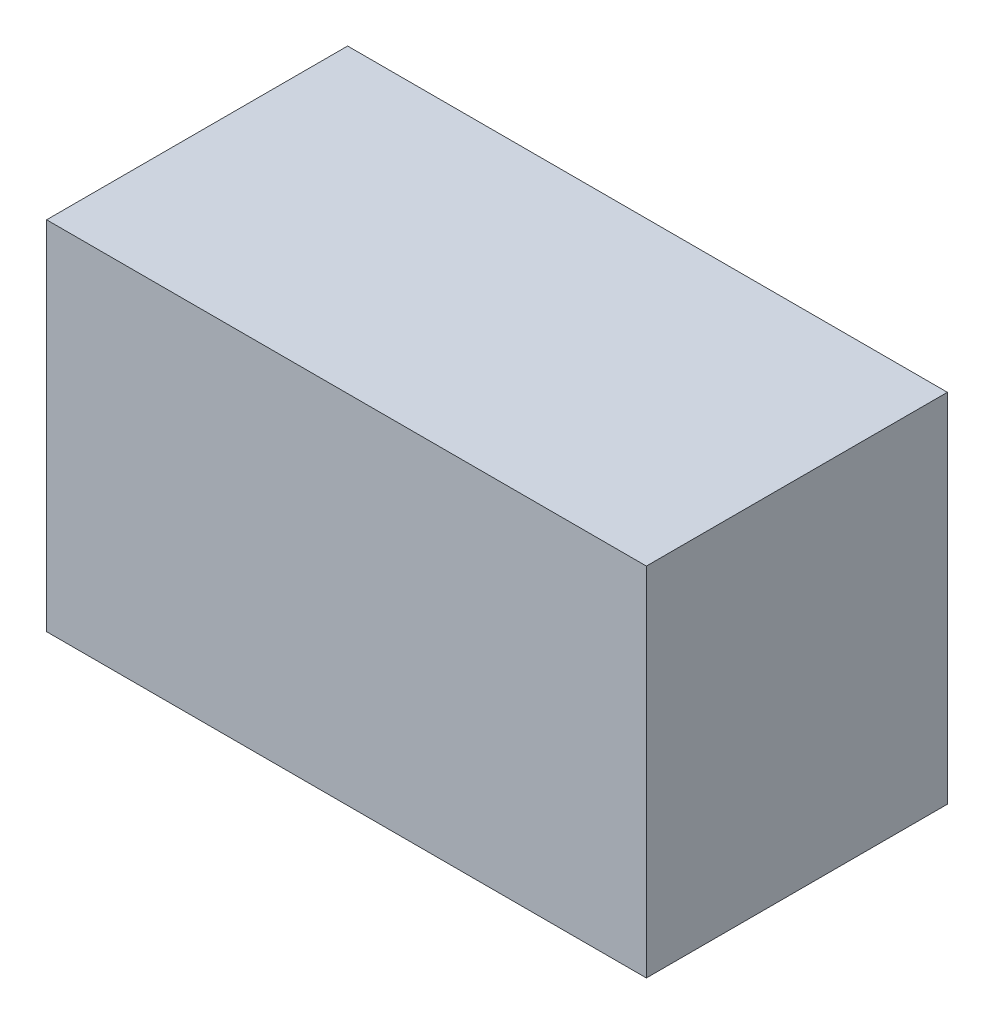
ISO-10303-21;
HEADER;
FILE_DESCRIPTION(('STEP AP214'),'2;1');
FILE_NAME('part.step','',(''),(''),'','','');
FILE_SCHEMA(('AUTOMOTIVE_DESIGN { 1 0 10303 214 1 1 1 1 }'));
ENDSEC;
DATA;
#1=APPLICATION_CONTEXT('core data for automotive mechanical design processes');
#2=APPLICATION_PROTOCOL_DEFINITION('international standard','automotive_design',2000,#1);
#3=PRODUCT_CONTEXT('',#1,'mechanical');
#4=PRODUCT('Part','Part','',(#3));
#5=PRODUCT_RELATED_PRODUCT_CATEGORY('part','',(#4));
#6=PRODUCT_DEFINITION_FORMATION('','',#4);
#7=PRODUCT_DEFINITION_CONTEXT('part definition',#1,'design');
#8=PRODUCT_DEFINITION('design','',#6,#7);
#9=PRODUCT_DEFINITION_SHAPE('','',#8);
#10=(LENGTH_UNIT() NAMED_UNIT(*) SI_UNIT(.MILLI.,.METRE.));
#11=(NAMED_UNIT(*) PLANE_ANGLE_UNIT() SI_UNIT($,.RADIAN.));
#12=(NAMED_UNIT(*) SI_UNIT($,.STERADIAN.) SOLID_ANGLE_UNIT());
#13=UNCERTAINTY_MEASURE_WITH_UNIT(LENGTH_MEASURE(1.E-05),#10,'distance_accuracy_value','');
#14=(GEOMETRIC_REPRESENTATION_CONTEXT(3) GLOBAL_UNCERTAINTY_ASSIGNED_CONTEXT((#13)) GLOBAL_UNIT_ASSIGNED_CONTEXT((#10,
#11,#12)) REPRESENTATION_CONTEXT('',''));
#15=CARTESIAN_POINT('',(0.,0.,0.));
#16=DIRECTION('',(0.,0.,1.));
#17=DIRECTION('',(1.,0.,0.));
#18=AXIS2_PLACEMENT_3D('',#15,#16,#17);
#19=CARTESIAN_POINT('',(-1.34499626250312,0.799968336574779,0.));
#20=DIRECTION('',(-1.,4.37113882867379E-08,0.));
#21=DIRECTION('',(-4.37113882867379E-08,-1.,0.));
#22=AXIS2_PLACEMENT_3D('',#19,#20,#21);
#23=PLANE('',#22);
#24=DIRECTION('',(-4.37113882998162E-08,-0.999999999999999,0.));
#25=VECTOR('',#24,1.);
#26=CARTESIAN_POINT('',(-1.34499626250312,0.799968336574779,0.));
#27=LINE('',#26,#25);
#28=CARTESIAN_POINT('',(-1.34499626250312,0.799968336574779,0.));
#29=VERTEX_POINT('',#28);
#30=CARTESIAN_POINT('',(-1.34499633244093,-0.800022508151784,0.));
#31=VERTEX_POINT('',#30);
#32=EDGE_CURVE('E11',#29,#31,#27,.T.);
#33=ORIENTED_EDGE('',*,*,#32,.T.);
#34=DIRECTION('',(0.,0.,1.));
#35=VECTOR('',#34,1.);
#36=CARTESIAN_POINT('',(-1.34499633244094,-0.800022508151784,0.));
#37=LINE('',#36,#35);
#38=CARTESIAN_POINT('',(-1.34499633244093,-0.800022508151784,1.34999978542328));
#39=VERTEX_POINT('',#38);
#40=EDGE_CURVE('E88',#31,#39,#37,.T.);
#41=ORIENTED_EDGE('',*,*,#40,.T.);
#42=DIRECTION('',(-4.37113882998162E-08,-0.999999999999999,0.));
#43=VECTOR('',#42,1.);
#44=CARTESIAN_POINT('',(-1.34499626250312,0.799968336574779,1.34999978542328));
#45=LINE('',#44,#43);
#46=CARTESIAN_POINT('',(-1.34499626250312,0.799968336574779,1.34999978542328));
#47=VERTEX_POINT('',#46);
#48=EDGE_CURVE('E83',#47,#39,#45,.T.);
#49=ORIENTED_EDGE('',*,*,#48,.F.);
#50=DIRECTION('',(0.,0.,1.));
#51=VECTOR('',#50,1.);
#52=CARTESIAN_POINT('',(-1.34499626250312,0.799968336574781,0.));
#53=LINE('',#52,#51);
#54=EDGE_CURVE('E72',#29,#47,#53,.T.);
#55=ORIENTED_EDGE('',*,*,#54,.F.);
#56=EDGE_LOOP('',(#33,#41,#49,#55));
#57=FACE_BOUND('',#56,.T.);
#58=ADVANCED_FACE('F17',(#57),#23,.T.);
#59=CARTESIAN_POINT('',(-1.34499633244093,-0.800022508151784,0.));
#60=DIRECTION('',(-4.37113882867379E-08,-1.,0.));
#61=DIRECTION('',(1.,-4.37113882867379E-08,0.));
#62=AXIS2_PLACEMENT_3D('',#59,#60,#61);
#63=PLANE('',#62);
#64=DIRECTION('',(0.999999999999999,-4.37113882791606E-08,0.));
#65=VECTOR('',#64,1.);
#66=CARTESIAN_POINT('',(-1.34499633244093,-0.800022508151784,0.));
#67=LINE('',#66,#65);
#68=CARTESIAN_POINT('',(1.34500610896532,-0.800022625735522,0.));
#69=VERTEX_POINT('',#68);
#70=EDGE_CURVE('E24',#31,#69,#67,.T.);
#71=ORIENTED_EDGE('',*,*,#70,.T.);
#72=DIRECTION('',(0.,0.,1.));
#73=VECTOR('',#72,1.);
#74=CARTESIAN_POINT('',(1.34500610896532,-0.800022625735525,0.));
#75=LINE('',#74,#73);
#76=CARTESIAN_POINT('',(1.34500610896532,-0.800022625735522,1.34999978542328));
#77=VERTEX_POINT('',#76);
#78=EDGE_CURVE('E85',#69,#77,#75,.T.);
#79=ORIENTED_EDGE('',*,*,#78,.T.);
#80=DIRECTION('',(0.999999999999999,-4.37113882791606E-08,0.));
#81=VECTOR('',#80,1.);
#82=CARTESIAN_POINT('',(-1.34499633244093,-0.800022508151784,1.34999978542328));
#83=LINE('',#82,#81);
#84=EDGE_CURVE('E66',#39,#77,#83,.T.);
#85=ORIENTED_EDGE('',*,*,#84,.F.);
#86=ORIENTED_EDGE('',*,*,#40,.F.);
#87=EDGE_LOOP('',(#71,#79,#85,#86));
#88=FACE_BOUND('',#87,.T.);
#89=ADVANCED_FACE('F89',(#88),#63,.T.);
#90=CARTESIAN_POINT('',(1.34500610896532,-0.800022625735522,0.));
#91=DIRECTION('',(1.,-4.37113882867379E-08,0.));
#92=DIRECTION('',(4.37113882867379E-08,1.,0.));
#93=AXIS2_PLACEMENT_3D('',#90,#91,#92);
#94=PLANE('',#93);
#95=DIRECTION('',(4.37113882998162E-08,0.999999999999999,0.));
#96=VECTOR('',#95,1.);
#97=CARTESIAN_POINT('',(1.34500610896532,-0.800022625735522,0.));
#98=LINE('',#97,#96);
#99=CARTESIAN_POINT('',(1.34500617890313,0.79996821899104,0.));
#100=VERTEX_POINT('',#99);
#101=EDGE_CURVE('E62',#69,#100,#98,.T.);
#102=ORIENTED_EDGE('',*,*,#101,.T.);
#103=DIRECTION('',(0.,0.,1.));
#104=VECTOR('',#103,1.);
#105=CARTESIAN_POINT('',(1.34500617890314,0.79996821899104,0.));
#106=LINE('',#105,#104);
#107=CARTESIAN_POINT('',(1.34500617890313,0.79996821899104,1.34999978542328));
#108=VERTEX_POINT('',#107);
#109=EDGE_CURVE('E55',#100,#108,#106,.T.);
#110=ORIENTED_EDGE('',*,*,#109,.T.);
#111=DIRECTION('',(4.37113882998162E-08,0.999999999999999,0.));
#112=VECTOR('',#111,1.);
#113=CARTESIAN_POINT('',(1.34500610896532,-0.800022625735522,1.34999978542328));
#114=LINE('',#113,#112);
#115=EDGE_CURVE('E59',#77,#108,#114,.T.);
#116=ORIENTED_EDGE('',*,*,#115,.F.);
#117=ORIENTED_EDGE('',*,*,#78,.F.);
#118=EDGE_LOOP('',(#102,#110,#116,#117));
#119=FACE_BOUND('',#118,.T.);
#120=ADVANCED_FACE('F57',(#119),#94,.T.);
#121=CARTESIAN_POINT('',(1.34500617890313,0.79996821899104,0.));
#122=DIRECTION('',(4.37113882867379E-08,1.,0.));
#123=DIRECTION('',(-1.,4.37113882867379E-08,0.));
#124=AXIS2_PLACEMENT_3D('',#121,#122,#123);
#125=PLANE('',#124);
#126=DIRECTION('',(-0.999999999999999,4.37113882791606E-08,0.));
#127=VECTOR('',#126,1.);
#128=CARTESIAN_POINT('',(1.34500617890313,0.79996821899104,0.));
#129=LINE('',#128,#127);
#130=EDGE_CURVE('E65',#100,#29,#129,.T.);
#131=ORIENTED_EDGE('',*,*,#130,.T.);
#132=ORIENTED_EDGE('',*,*,#54,.T.);
#133=DIRECTION('',(-0.999999999999999,4.37113882791606E-08,0.));
#134=VECTOR('',#133,1.);
#135=CARTESIAN_POINT('',(1.34500617890313,0.79996821899104,1.34999978542328));
#136=LINE('',#135,#134);
#137=EDGE_CURVE('E70',#108,#47,#136,.T.);
#138=ORIENTED_EDGE('',*,*,#137,.F.);
#139=ORIENTED_EDGE('',*,*,#109,.F.);
#140=EDGE_LOOP('',(#131,#132,#138,#139));
#141=FACE_BOUND('',#140,.T.);
#142=ADVANCED_FACE('F71',(#141),#125,.T.);
#143=CARTESIAN_POINT('',(-97.3749923706055,236.449981689453,1.34999978542328));
#144=DIRECTION('',(0.,0.,1.));
#145=DIRECTION('',(-4.37113882867379E-08,-1.,0.));
#146=AXIS2_PLACEMENT_3D('',#143,#144,#145);
#147=PLANE('',#146);
#148=ORIENTED_EDGE('',*,*,#48,.T.);
#149=ORIENTED_EDGE('',*,*,#84,.T.);
#150=ORIENTED_EDGE('',*,*,#115,.T.);
#151=ORIENTED_EDGE('',*,*,#137,.T.);
#152=EDGE_LOOP('',(#148,#149,#150,#151));
#153=FACE_BOUND('',#152,.T.);
#154=ADVANCED_FACE('F76',(#153),#147,.T.);
#155=CARTESIAN_POINT('',(-97.3749923706055,236.449981689453,0.));
#156=DIRECTION('',(0.,0.,1.));
#157=DIRECTION('',(-4.37113882867379E-08,-1.,0.));
#158=AXIS2_PLACEMENT_3D('',#155,#156,#157);
#159=PLANE('',#158);
#160=ORIENTED_EDGE('',*,*,#130,.F.);
#161=ORIENTED_EDGE('',*,*,#101,.F.);
#162=ORIENTED_EDGE('',*,*,#70,.F.);
#163=ORIENTED_EDGE('',*,*,#32,.F.);
#164=EDGE_LOOP('',(#160,#161,#162,#163));
#165=FACE_BOUND('',#164,.T.);
#166=ADVANCED_FACE('F91',(#165),#159,.F.);
#167=CLOSED_SHELL('',(#58,#89,#120,#142,#154,#166));
#168=MANIFOLD_SOLID_BREP('B1',#167);
#169=ADVANCED_BREP_SHAPE_REPRESENTATION('',(#18,#168),#14);
#170=SHAPE_DEFINITION_REPRESENTATION(#9,#169);
ENDSEC;
END-ISO-10303-21;
